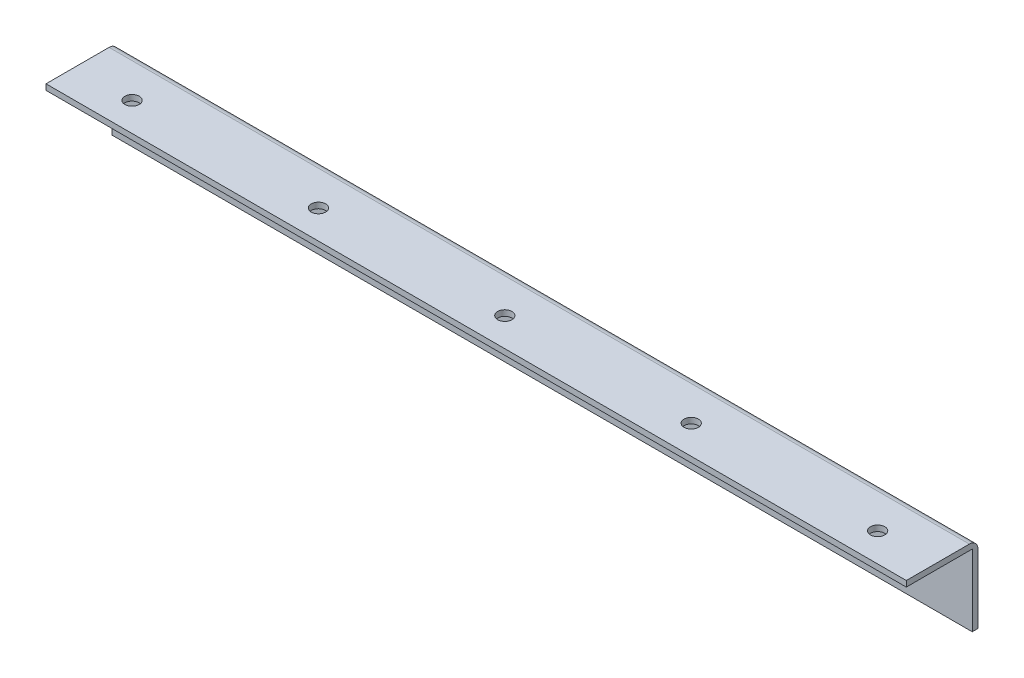
ISO-10303-21;
HEADER;
FILE_DESCRIPTION(('STEP AP214'),'2;1');
FILE_NAME('part.step','',(''),(''),'','','');
FILE_SCHEMA(('AUTOMOTIVE_DESIGN { 1 0 10303 214 1 1 1 1 }'));
ENDSEC;
DATA;
#1=APPLICATION_CONTEXT('core data for automotive mechanical design processes');
#2=APPLICATION_PROTOCOL_DEFINITION('international standard','automotive_design',2000,#1);
#3=PRODUCT_CONTEXT('',#1,'mechanical');
#4=PRODUCT('Part','Part','',(#3));
#5=PRODUCT_RELATED_PRODUCT_CATEGORY('part','',(#4));
#6=PRODUCT_DEFINITION_FORMATION('','',#4);
#7=PRODUCT_DEFINITION_CONTEXT('part definition',#1,'design');
#8=PRODUCT_DEFINITION('design','',#6,#7);
#9=PRODUCT_DEFINITION_SHAPE('','',#8);
#10=(LENGTH_UNIT() NAMED_UNIT(*) SI_UNIT(.MILLI.,.METRE.));
#11=(NAMED_UNIT(*) PLANE_ANGLE_UNIT() SI_UNIT($,.RADIAN.));
#12=(NAMED_UNIT(*) SI_UNIT($,.STERADIAN.) SOLID_ANGLE_UNIT());
#13=UNCERTAINTY_MEASURE_WITH_UNIT(LENGTH_MEASURE(1.E-05),#10,'distance_accuracy_value','');
#14=(GEOMETRIC_REPRESENTATION_CONTEXT(3) GLOBAL_UNCERTAINTY_ASSIGNED_CONTEXT((#13)) GLOBAL_UNIT_ASSIGNED_CONTEXT((#10,
#11,#12)) REPRESENTATION_CONTEXT('',''));
#15=CARTESIAN_POINT('',(0.,0.,0.));
#16=DIRECTION('',(0.,0.,1.));
#17=DIRECTION('',(1.,0.,0.));
#18=AXIS2_PLACEMENT_3D('',#15,#16,#17);
#19=CARTESIAN_POINT('',(0.,0.,0.));
#20=DIRECTION('',(0.,1.,0.));
#21=DIRECTION('',(0.,0.,1.));
#22=AXIS2_PLACEMENT_3D('',#19,#20,#21);
#23=PLANE('',#22);
#24=CARTESIAN_POINT('',(130.,0.,2.50000000000002));
#25=DIRECTION('',(0.,1.,0.));
#26=DIRECTION('',(0.,0.,-1.));
#27=AXIS2_PLACEMENT_3D('',#24,#25,#26);
#28=CIRCLE('',#27,2.5);
#29=CARTESIAN_POINT('',(130.,0.,0.));
#30=VERTEX_POINT('',#29);
#31=EDGE_CURVE('E146',#30,#30,#28,.T.);
#32=ORIENTED_EDGE('',*,*,#31,.T.);
#33=EDGE_LOOP('',(#32));
#34=FACE_BOUND('',#33,.T.);
#35=CARTESIAN_POINT('',(65.,0.,2.50000000000002));
#36=DIRECTION('',(0.,1.,0.));
#37=DIRECTION('',(0.,0.,-1.));
#38=AXIS2_PLACEMENT_3D('',#35,#36,#37);
#39=CIRCLE('',#38,2.49999999999999);
#40=CARTESIAN_POINT('',(65.,0.,0.));
#41=VERTEX_POINT('',#40);
#42=EDGE_CURVE('E140',#41,#41,#39,.T.);
#43=ORIENTED_EDGE('',*,*,#42,.T.);
#44=EDGE_LOOP('',(#43));
#45=FACE_BOUND('',#44,.T.);
#46=CARTESIAN_POINT('',(0.,0.,2.50000000000002));
#47=DIRECTION('',(0.,1.,0.));
#48=DIRECTION('',(0.,0.,1.));
#49=AXIS2_PLACEMENT_3D('',#46,#47,#48);
#50=CIRCLE('',#49,2.5);
#51=CARTESIAN_POINT('',(0.,0.,5.00000000000002));
#52=VERTEX_POINT('',#51);
#53=EDGE_CURVE('E134',#52,#52,#50,.T.);
#54=ORIENTED_EDGE('',*,*,#53,.T.);
#55=EDGE_LOOP('',(#54));
#56=FACE_BOUND('',#55,.T.);
#57=CARTESIAN_POINT('',(-65.,0.,2.50000000000002));
#58=DIRECTION('',(0.,1.,0.));
#59=DIRECTION('',(0.,0.,1.));
#60=AXIS2_PLACEMENT_3D('',#57,#58,#59);
#61=CIRCLE('',#60,2.49999999999999);
#62=CARTESIAN_POINT('',(-65.,0.,5.00000000000001));
#63=VERTEX_POINT('',#62);
#64=EDGE_CURVE('E128',#63,#63,#61,.T.);
#65=ORIENTED_EDGE('',*,*,#64,.T.);
#66=EDGE_LOOP('',(#65));
#67=FACE_BOUND('',#66,.T.);
#68=CARTESIAN_POINT('',(-130.,0.,2.50000000000002));
#69=DIRECTION('',(0.,1.,0.));
#70=DIRECTION('',(0.,0.,1.));
#71=AXIS2_PLACEMENT_3D('',#68,#69,#70);
#72=CIRCLE('',#71,2.5);
#73=CARTESIAN_POINT('',(-130.,0.,5.00000000000001));
#74=VERTEX_POINT('',#73);
#75=EDGE_CURVE('E121',#74,#74,#72,.T.);
#76=ORIENTED_EDGE('',*,*,#75,.T.);
#77=EDGE_LOOP('',(#76));
#78=FACE_BOUND('',#77,.T.);
#79=DIRECTION('',(-1.,0.,0.));
#80=VECTOR('',#79,1.);
#81=CARTESIAN_POINT('',(-150.,0.,-10.5));
#82=LINE('',#81,#80);
#83=CARTESIAN_POINT('',(150.,0.,-10.5));
#84=VERTEX_POINT('',#83);
#85=CARTESIAN_POINT('',(-150.,0.,-10.5));
#86=VERTEX_POINT('',#85);
#87=EDGE_CURVE('E108',#84,#86,#82,.T.);
#88=ORIENTED_EDGE('',*,*,#87,.F.);
#89=DIRECTION('',(0.,0.,-1.));
#90=VECTOR('',#89,1.);
#91=CARTESIAN_POINT('',(150.,0.,12.5));
#92=LINE('',#91,#90);
#93=CARTESIAN_POINT('',(150.,0.,12.5));
#94=VERTEX_POINT('',#93);
#95=EDGE_CURVE('E154',#94,#84,#92,.T.);
#96=ORIENTED_EDGE('',*,*,#95,.F.);
#97=DIRECTION('',(1.,0.,0.));
#98=VECTOR('',#97,1.);
#99=CARTESIAN_POINT('',(150.,0.,12.5));
#100=LINE('',#99,#98);
#101=CARTESIAN_POINT('',(-150.,0.,12.5));
#102=VERTEX_POINT('',#101);
#103=EDGE_CURVE('E159',#102,#94,#100,.T.);
#104=ORIENTED_EDGE('',*,*,#103,.F.);
#105=DIRECTION('',(0.,0.,1.));
#106=VECTOR('',#105,1.);
#107=CARTESIAN_POINT('',(-150.,0.,12.5));
#108=LINE('',#107,#106);
#109=EDGE_CURVE('E124',#86,#102,#108,.T.);
#110=ORIENTED_EDGE('',*,*,#109,.F.);
#111=EDGE_LOOP('',(#88,#96,#104,#110));
#112=FACE_BOUND('',#111,.T.);
#113=ADVANCED_FACE('F33',(#34,#45,#56,#67,#78,#112),#23,.F.);
#114=CARTESIAN_POINT('',(-150.,2.,12.5));
#115=DIRECTION('',(1.,0.,0.));
#116=DIRECTION('',(0.,0.,-1.));
#117=AXIS2_PLACEMENT_3D('',#114,#115,#116);
#118=PLANE('',#117);
#119=DIRECTION('',(0.,0.,1.));
#120=VECTOR('',#119,1.);
#121=CARTESIAN_POINT('',(-150.,2.,12.5));
#122=LINE('',#121,#120);
#123=CARTESIAN_POINT('',(-150.,2.,-9.49999999999999));
#124=VERTEX_POINT('',#123);
#125=CARTESIAN_POINT('',(-150.,2.,12.5));
#126=VERTEX_POINT('',#125);
#127=EDGE_CURVE('E151',#124,#126,#122,.T.);
#128=ORIENTED_EDGE('',*,*,#127,.F.);
#129=CARTESIAN_POINT('',(-150.,-1.,-9.49999999999999));
#130=DIRECTION('',(1.,0.,0.));
#131=DIRECTION('',(0.,0.,-1.));
#132=AXIS2_PLACEMENT_3D('',#129,#130,#131);
#133=CIRCLE('',#132,3.);
#134=CARTESIAN_POINT('',(-150.,-1.,-12.5));
#135=VERTEX_POINT('',#134);
#136=EDGE_CURVE('E55',#124,#135,#133,.F.);
#137=ORIENTED_EDGE('',*,*,#136,.T.);
#138=DIRECTION('',(0.,-1.,0.));
#139=VECTOR('',#138,1.);
#140=CARTESIAN_POINT('',(-150.,2.,-12.5));
#141=LINE('',#140,#139);
#142=CARTESIAN_POINT('',(-150.,-25.,-12.5));
#143=VERTEX_POINT('',#142);
#144=EDGE_CURVE('E88',#135,#143,#141,.T.);
#145=ORIENTED_EDGE('',*,*,#144,.T.);
#146=DIRECTION('',(0.,0.,-1.));
#147=VECTOR('',#146,1.);
#148=CARTESIAN_POINT('',(-150.,-25.,-12.5));
#149=LINE('',#148,#147);
#150=CARTESIAN_POINT('',(-150.,-25.,-10.5));
#151=VERTEX_POINT('',#150);
#152=EDGE_CURVE('E93',#151,#143,#149,.T.);
#153=ORIENTED_EDGE('',*,*,#152,.F.);
#154=DIRECTION('',(0.,1.,0.));
#155=VECTOR('',#154,1.);
#156=CARTESIAN_POINT('',(-150.,-25.,-10.5));
#157=LINE('',#156,#155);
#158=EDGE_CURVE('E114',#151,#86,#157,.T.);
#159=ORIENTED_EDGE('',*,*,#158,.T.);
#160=ORIENTED_EDGE('',*,*,#109,.T.);
#161=DIRECTION('',(0.,-1.,0.));
#162=VECTOR('',#161,1.);
#163=CARTESIAN_POINT('',(-150.,2.,12.5));
#164=LINE('',#163,#162);
#165=EDGE_CURVE('E167',#126,#102,#164,.T.);
#166=ORIENTED_EDGE('',*,*,#165,.F.);
#167=EDGE_LOOP('',(#128,#137,#145,#153,#159,#160,#166));
#168=FACE_BOUND('',#167,.T.);
#169=ADVANCED_FACE('F90',(#168),#118,.F.);
#170=CARTESIAN_POINT('',(150.,2.,12.5));
#171=DIRECTION('',(0.,0.,-1.));
#172=DIRECTION('',(-1.,0.,0.));
#173=AXIS2_PLACEMENT_3D('',#170,#171,#172);
#174=PLANE('',#173);
#175=ORIENTED_EDGE('',*,*,#103,.T.);
#176=DIRECTION('',(0.,-1.,0.));
#177=VECTOR('',#176,1.);
#178=CARTESIAN_POINT('',(150.,2.,12.5));
#179=LINE('',#178,#177);
#180=CARTESIAN_POINT('',(150.,2.,12.5));
#181=VERTEX_POINT('',#180);
#182=EDGE_CURVE('E164',#181,#94,#179,.T.);
#183=ORIENTED_EDGE('',*,*,#182,.F.);
#184=DIRECTION('',(1.,0.,0.));
#185=VECTOR('',#184,1.);
#186=CARTESIAN_POINT('',(150.,2.,12.5));
#187=LINE('',#186,#185);
#188=EDGE_CURVE('E153',#126,#181,#187,.T.);
#189=ORIENTED_EDGE('',*,*,#188,.F.);
#190=ORIENTED_EDGE('',*,*,#165,.T.);
#191=EDGE_LOOP('',(#175,#183,#189,#190));
#192=FACE_BOUND('',#191,.T.);
#193=ADVANCED_FACE('F183',(#192),#174,.F.);
#194=CARTESIAN_POINT('',(150.,2.,12.5));
#195=DIRECTION('',(-1.,0.,0.));
#196=DIRECTION('',(0.,0.,1.));
#197=AXIS2_PLACEMENT_3D('',#194,#195,#196);
#198=PLANE('',#197);
#199=DIRECTION('',(0.,-1.,0.));
#200=VECTOR('',#199,1.);
#201=CARTESIAN_POINT('',(150.,2.,-12.5));
#202=LINE('',#201,#200);
#203=CARTESIAN_POINT('',(150.,-1.,-12.5));
#204=VERTEX_POINT('',#203);
#205=CARTESIAN_POINT('',(150.,-25.,-12.5));
#206=VERTEX_POINT('',#205);
#207=EDGE_CURVE('E94',#204,#206,#202,.T.);
#208=ORIENTED_EDGE('',*,*,#207,.F.);
#209=CARTESIAN_POINT('',(150.,-1.,-9.50000000000002));
#210=DIRECTION('',(-1.,0.,0.));
#211=DIRECTION('',(0.,0.,1.));
#212=AXIS2_PLACEMENT_3D('',#209,#210,#211);
#213=CIRCLE('',#212,3.);
#214=CARTESIAN_POINT('',(150.,2.,-9.50000000000002));
#215=VERTEX_POINT('',#214);
#216=EDGE_CURVE('E11',#204,#215,#213,.F.);
#217=ORIENTED_EDGE('',*,*,#216,.T.);
#218=DIRECTION('',(0.,0.,-1.));
#219=VECTOR('',#218,1.);
#220=CARTESIAN_POINT('',(150.,2.,12.5));
#221=LINE('',#220,#219);
#222=EDGE_CURVE('E95',#181,#215,#221,.T.);
#223=ORIENTED_EDGE('',*,*,#222,.F.);
#224=ORIENTED_EDGE('',*,*,#182,.T.);
#225=ORIENTED_EDGE('',*,*,#95,.T.);
#226=DIRECTION('',(0.,1.,0.));
#227=VECTOR('',#226,1.);
#228=CARTESIAN_POINT('',(150.,-25.,-10.5));
#229=LINE('',#228,#227);
#230=CARTESIAN_POINT('',(150.,-25.,-10.5));
#231=VERTEX_POINT('',#230);
#232=EDGE_CURVE('E117',#231,#84,#229,.T.);
#233=ORIENTED_EDGE('',*,*,#232,.F.);
#234=DIRECTION('',(0.,0.,1.));
#235=VECTOR('',#234,1.);
#236=CARTESIAN_POINT('',(150.,-25.,-12.5));
#237=LINE('',#236,#235);
#238=EDGE_CURVE('E102',#206,#231,#237,.T.);
#239=ORIENTED_EDGE('',*,*,#238,.F.);
#240=EDGE_LOOP('',(#208,#217,#223,#224,#225,#233,#239));
#241=FACE_BOUND('',#240,.T.);
#242=ADVANCED_FACE('F187',(#241),#198,.F.);
#243=CARTESIAN_POINT('',(150.,2.,-12.5));
#244=DIRECTION('',(0.,0.,1.));
#245=DIRECTION('',(1.,0.,0.));
#246=AXIS2_PLACEMENT_3D('',#243,#244,#245);
#247=PLANE('',#246);
#248=ORIENTED_EDGE('',*,*,#144,.F.);
#249=DIRECTION('',(-1.,0.,0.));
#250=VECTOR('',#249,1.);
#251=CARTESIAN_POINT('',(150.,-1.,-12.5));
#252=LINE('',#251,#250);
#253=EDGE_CURVE('E41',#135,#204,#252,.F.);
#254=ORIENTED_EDGE('',*,*,#253,.T.);
#255=ORIENTED_EDGE('',*,*,#207,.T.);
#256=DIRECTION('',(1.,0.,0.));
#257=VECTOR('',#256,1.);
#258=CARTESIAN_POINT('',(-150.,-25.,-12.5));
#259=LINE('',#258,#257);
#260=EDGE_CURVE('E98',#143,#206,#259,.T.);
#261=ORIENTED_EDGE('',*,*,#260,.F.);
#262=EDGE_LOOP('',(#248,#254,#255,#261));
#263=FACE_BOUND('',#262,.T.);
#264=ADVANCED_FACE('F99',(#263),#247,.F.);
#265=CARTESIAN_POINT('',(0.,2.,0.));
#266=DIRECTION('',(0.,1.,0.));
#267=DIRECTION('',(0.,0.,1.));
#268=AXIS2_PLACEMENT_3D('',#265,#266,#267);
#269=PLANE('',#268);
#270=CARTESIAN_POINT('',(-130.,2.,2.50000000000002));
#271=DIRECTION('',(0.,1.,0.));
#272=DIRECTION('',(0.,0.,1.));
#273=AXIS2_PLACEMENT_3D('',#270,#271,#272);
#274=CIRCLE('',#273,2.5);
#275=CARTESIAN_POINT('',(-130.,2.,5.00000000000001));
#276=VERTEX_POINT('',#275);
#277=EDGE_CURVE('E125',#276,#276,#274,.T.);
#278=ORIENTED_EDGE('',*,*,#277,.F.);
#279=EDGE_LOOP('',(#278));
#280=FACE_BOUND('',#279,.T.);
#281=CARTESIAN_POINT('',(-65.,2.,2.50000000000002));
#282=DIRECTION('',(0.,1.,0.));
#283=DIRECTION('',(0.,0.,1.));
#284=AXIS2_PLACEMENT_3D('',#281,#282,#283);
#285=CIRCLE('',#284,2.49999999999999);
#286=CARTESIAN_POINT('',(-65.,2.,5.00000000000001));
#287=VERTEX_POINT('',#286);
#288=EDGE_CURVE('E131',#287,#287,#285,.T.);
#289=ORIENTED_EDGE('',*,*,#288,.F.);
#290=EDGE_LOOP('',(#289));
#291=FACE_BOUND('',#290,.T.);
#292=CARTESIAN_POINT('',(0.,2.,2.50000000000002));
#293=DIRECTION('',(0.,1.,0.));
#294=DIRECTION('',(0.,0.,1.));
#295=AXIS2_PLACEMENT_3D('',#292,#293,#294);
#296=CIRCLE('',#295,2.5);
#297=CARTESIAN_POINT('',(0.,2.,5.00000000000002));
#298=VERTEX_POINT('',#297);
#299=EDGE_CURVE('E137',#298,#298,#296,.T.);
#300=ORIENTED_EDGE('',*,*,#299,.F.);
#301=EDGE_LOOP('',(#300));
#302=FACE_BOUND('',#301,.T.);
#303=CARTESIAN_POINT('',(65.,2.,2.50000000000002));
#304=DIRECTION('',(0.,1.,0.));
#305=DIRECTION('',(0.,0.,-1.));
#306=AXIS2_PLACEMENT_3D('',#303,#304,#305);
#307=CIRCLE('',#306,2.49999999999999);
#308=CARTESIAN_POINT('',(65.,2.,0.));
#309=VERTEX_POINT('',#308);
#310=EDGE_CURVE('E143',#309,#309,#307,.T.);
#311=ORIENTED_EDGE('',*,*,#310,.F.);
#312=EDGE_LOOP('',(#311));
#313=FACE_BOUND('',#312,.T.);
#314=CARTESIAN_POINT('',(130.,2.,2.50000000000002));
#315=DIRECTION('',(0.,1.,0.));
#316=DIRECTION('',(0.,0.,-1.));
#317=AXIS2_PLACEMENT_3D('',#314,#315,#316);
#318=CIRCLE('',#317,2.5);
#319=CARTESIAN_POINT('',(130.,2.,0.));
#320=VERTEX_POINT('',#319);
#321=EDGE_CURVE('E120',#320,#320,#318,.T.);
#322=ORIENTED_EDGE('',*,*,#321,.F.);
#323=EDGE_LOOP('',(#322));
#324=FACE_BOUND('',#323,.T.);
#325=ORIENTED_EDGE('',*,*,#222,.T.);
#326=DIRECTION('',(-1.,0.,0.));
#327=VECTOR('',#326,1.);
#328=CARTESIAN_POINT('',(-150.,2.,-9.49999999999999));
#329=LINE('',#328,#327);
#330=EDGE_CURVE('E170',#215,#124,#329,.T.);
#331=ORIENTED_EDGE('',*,*,#330,.T.);
#332=ORIENTED_EDGE('',*,*,#127,.T.);
#333=ORIENTED_EDGE('',*,*,#188,.T.);
#334=EDGE_LOOP('',(#325,#331,#332,#333));
#335=FACE_BOUND('',#334,.T.);
#336=ADVANCED_FACE('F175',(#280,#291,#302,#313,#324,#335),#269,.T.);
#337=CARTESIAN_POINT('',(130.,0.,2.50000000000002));
#338=DIRECTION('',(0.,1.,0.));
#339=DIRECTION('',(0.,0.,1.));
#340=AXIS2_PLACEMENT_3D('',#337,#338,#339);
#341=CYLINDRICAL_SURFACE('',#340,2.5);
#342=ORIENTED_EDGE('',*,*,#31,.F.);
#343=EDGE_LOOP('',(#342));
#344=FACE_BOUND('',#343,.T.);
#345=ORIENTED_EDGE('',*,*,#321,.T.);
#346=EDGE_LOOP('',(#345));
#347=FACE_BOUND('',#346,.T.);
#348=ADVANCED_FACE('F228',(#344,#347),#341,.F.);
#349=CARTESIAN_POINT('',(65.,0.,2.50000000000002));
#350=DIRECTION('',(0.,1.,0.));
#351=DIRECTION('',(0.,0.,1.));
#352=AXIS2_PLACEMENT_3D('',#349,#350,#351);
#353=CYLINDRICAL_SURFACE('',#352,2.49999999999999);
#354=ORIENTED_EDGE('',*,*,#42,.F.);
#355=EDGE_LOOP('',(#354));
#356=FACE_BOUND('',#355,.T.);
#357=ORIENTED_EDGE('',*,*,#310,.T.);
#358=EDGE_LOOP('',(#357));
#359=FACE_BOUND('',#358,.T.);
#360=ADVANCED_FACE('F234',(#356,#359),#353,.F.);
#361=CARTESIAN_POINT('',(0.,0.,2.50000000000002));
#362=DIRECTION('',(0.,1.,0.));
#363=DIRECTION('',(0.,0.,1.));
#364=AXIS2_PLACEMENT_3D('',#361,#362,#363);
#365=CYLINDRICAL_SURFACE('',#364,2.5);
#366=ORIENTED_EDGE('',*,*,#53,.F.);
#367=EDGE_LOOP('',(#366));
#368=FACE_BOUND('',#367,.T.);
#369=ORIENTED_EDGE('',*,*,#299,.T.);
#370=EDGE_LOOP('',(#369));
#371=FACE_BOUND('',#370,.T.);
#372=ADVANCED_FACE('F241',(#368,#371),#365,.F.);
#373=CARTESIAN_POINT('',(-65.,0.,2.50000000000002));
#374=DIRECTION('',(0.,1.,0.));
#375=DIRECTION('',(0.,0.,1.));
#376=AXIS2_PLACEMENT_3D('',#373,#374,#375);
#377=CYLINDRICAL_SURFACE('',#376,2.49999999999999);
#378=ORIENTED_EDGE('',*,*,#64,.F.);
#379=EDGE_LOOP('',(#378));
#380=FACE_BOUND('',#379,.T.);
#381=ORIENTED_EDGE('',*,*,#288,.T.);
#382=EDGE_LOOP('',(#381));
#383=FACE_BOUND('',#382,.T.);
#384=ADVANCED_FACE('F249',(#380,#383),#377,.F.);
#385=CARTESIAN_POINT('',(-130.,0.,2.50000000000002));
#386=DIRECTION('',(0.,1.,0.));
#387=DIRECTION('',(0.,0.,1.));
#388=AXIS2_PLACEMENT_3D('',#385,#386,#387);
#389=CYLINDRICAL_SURFACE('',#388,2.5);
#390=ORIENTED_EDGE('',*,*,#75,.F.);
#391=EDGE_LOOP('',(#390));
#392=FACE_BOUND('',#391,.T.);
#393=ORIENTED_EDGE('',*,*,#277,.T.);
#394=EDGE_LOOP('',(#393));
#395=FACE_BOUND('',#394,.T.);
#396=ADVANCED_FACE('F257',(#392,#395),#389,.F.);
#397=CARTESIAN_POINT('',(-150.,-25.,-10.5));
#398=DIRECTION('',(0.,0.,-1.));
#399=DIRECTION('',(-1.,0.,0.));
#400=AXIS2_PLACEMENT_3D('',#397,#398,#399);
#401=PLANE('',#400);
#402=ORIENTED_EDGE('',*,*,#87,.T.);
#403=ORIENTED_EDGE('',*,*,#158,.F.);
#404=DIRECTION('',(-1.,0.,0.));
#405=VECTOR('',#404,1.);
#406=CARTESIAN_POINT('',(-150.,-25.,-10.5));
#407=LINE('',#406,#405);
#408=EDGE_CURVE('E106',#231,#151,#407,.T.);
#409=ORIENTED_EDGE('',*,*,#408,.F.);
#410=ORIENTED_EDGE('',*,*,#232,.T.);
#411=EDGE_LOOP('',(#402,#403,#409,#410));
#412=FACE_BOUND('',#411,.T.);
#413=ADVANCED_FACE('F192',(#412),#401,.F.);
#414=CARTESIAN_POINT('',(0.,-25.,0.));
#415=DIRECTION('',(0.,1.,0.));
#416=DIRECTION('',(0.,0.,1.));
#417=AXIS2_PLACEMENT_3D('',#414,#415,#416);
#418=PLANE('',#417);
#419=ORIENTED_EDGE('',*,*,#152,.T.);
#420=ORIENTED_EDGE('',*,*,#260,.T.);
#421=ORIENTED_EDGE('',*,*,#238,.T.);
#422=ORIENTED_EDGE('',*,*,#408,.T.);
#423=EDGE_LOOP('',(#419,#420,#421,#422));
#424=FACE_BOUND('',#423,.T.);
#425=ADVANCED_FACE('F104',(#424),#418,.F.);
#426=CARTESIAN_POINT('',(0.,-1.,-9.5));
#427=DIRECTION('',(1.,0.,0.));
#428=DIRECTION('',(0.,0.,-1.));
#429=AXIS2_PLACEMENT_3D('',#426,#427,#428);
#430=CYLINDRICAL_SURFACE('',#429,3.);
#431=ORIENTED_EDGE('',*,*,#216,.F.);
#432=ORIENTED_EDGE('',*,*,#253,.F.);
#433=ORIENTED_EDGE('',*,*,#136,.F.);
#434=ORIENTED_EDGE('',*,*,#330,.F.);
#435=EDGE_LOOP('',(#431,#432,#433,#434));
#436=FACE_BOUND('',#435,.T.);
#437=ADVANCED_FACE('F35',(#436),#430,.T.);
#438=CLOSED_SHELL('',(#113,#169,#193,#242,#264,#336,#348,#360,#372,#384,#396,#413,#425,#437));
#439=MANIFOLD_SOLID_BREP('B2',#438);
#440=ADVANCED_BREP_SHAPE_REPRESENTATION('',(#18,#439),#14);
#441=SHAPE_DEFINITION_REPRESENTATION(#9,#440);
ENDSEC;
END-ISO-10303-21;
